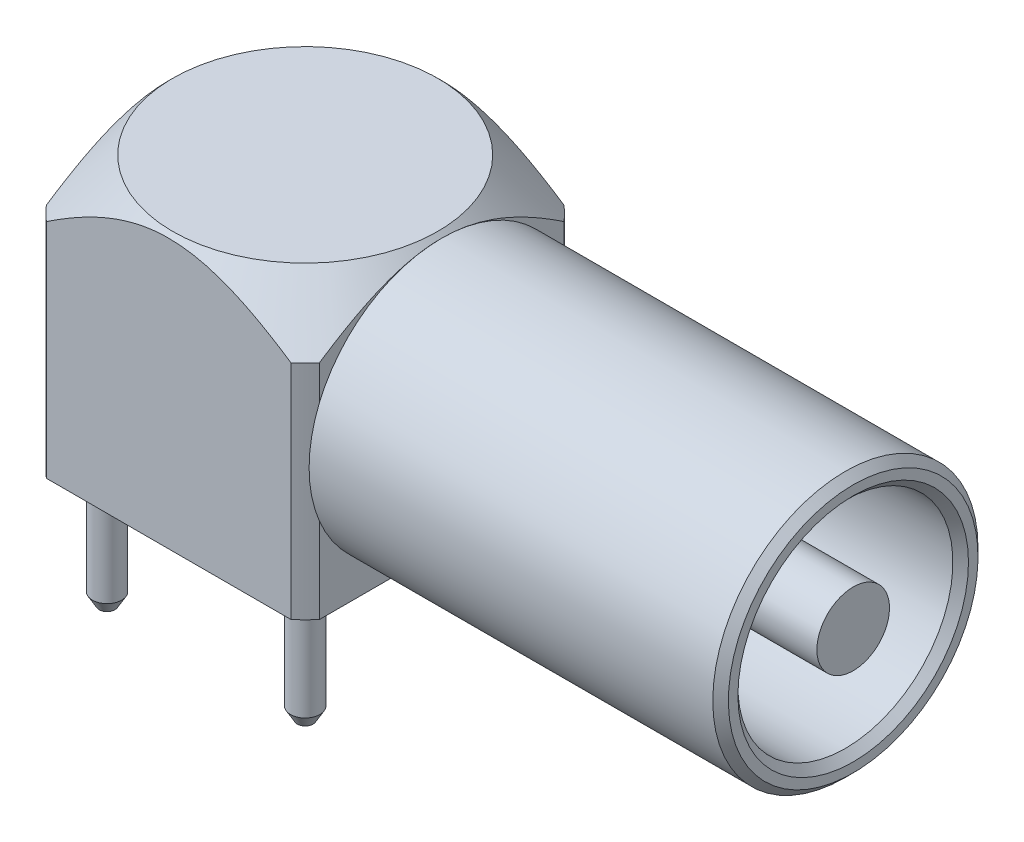
ISO-10303-21;
HEADER;
FILE_DESCRIPTION(('STEP AP214'),'2;1');
FILE_NAME('part.step','',(''),(''),'','','');
FILE_SCHEMA(('AUTOMOTIVE_DESIGN { 1 0 10303 214 1 1 1 1 }'));
ENDSEC;
DATA;
#1=APPLICATION_CONTEXT('core data for automotive mechanical design processes');
#2=APPLICATION_PROTOCOL_DEFINITION('international standard','automotive_design',2000,#1);
#3=PRODUCT_CONTEXT('',#1,'mechanical');
#4=PRODUCT('Part','Part','',(#3));
#5=PRODUCT_RELATED_PRODUCT_CATEGORY('part','',(#4));
#6=PRODUCT_DEFINITION_FORMATION('','',#4);
#7=PRODUCT_DEFINITION_CONTEXT('part definition',#1,'design');
#8=PRODUCT_DEFINITION('design','',#6,#7);
#9=PRODUCT_DEFINITION_SHAPE('','',#8);
#10=(LENGTH_UNIT() NAMED_UNIT(*) SI_UNIT(.MILLI.,.METRE.));
#11=(NAMED_UNIT(*) PLANE_ANGLE_UNIT() SI_UNIT($,.RADIAN.));
#12=(NAMED_UNIT(*) SI_UNIT($,.STERADIAN.) SOLID_ANGLE_UNIT());
#13=UNCERTAINTY_MEASURE_WITH_UNIT(LENGTH_MEASURE(1.E-05),#10,'distance_accuracy_value','');
#14=(GEOMETRIC_REPRESENTATION_CONTEXT(3) GLOBAL_UNCERTAINTY_ASSIGNED_CONTEXT((#13)) GLOBAL_UNIT_ASSIGNED_CONTEXT((#10,
#11,#12)) REPRESENTATION_CONTEXT('',''));
#15=CARTESIAN_POINT('',(0.,0.,0.));
#16=DIRECTION('',(0.,0.,1.));
#17=DIRECTION('',(1.,0.,0.));
#18=AXIS2_PLACEMENT_3D('',#15,#16,#17);
#19=CARTESIAN_POINT('',(-10.55,3.5,-8.75251334901552E-07));
#20=DIRECTION('',(1.,0.,0.));
#21=DIRECTION('',(0.,1.,0.));
#22=AXIS2_PLACEMENT_3D('',#19,#20,#21);
#23=PLANE('',#22);
#24=CARTESIAN_POINT('',(-10.55,2.2,-3.13687830352296));
#25=CARTESIAN_POINT('',(-10.55,3.4,-1.33891197268435));
#26=CARTESIAN_POINT('',(-10.55,3.4,-8.75251335255347E-07));
#27=(BOUNDED_CURVE() B_SPLINE_CURVE(2,(#24,#25,#26),.UNSPECIFIED.,.F.,
.F.) B_SPLINE_CURVE_WITH_KNOTS((3,3),(0.0289629394687463,0.378837270102338),
.UNSPECIFIED.) CURVE() GEOMETRIC_REPRESENTATION_ITEM() RATIONAL_B_SPLINE_CURVE((1.03045700832998,
1.20710678118655,1.20710678118655)) REPRESENTATION_ITEM(''));
#28=CARTESIAN_POINT('',(-10.55,2.2,-3.13687830352296));
#29=VERTEX_POINT('',#28);
#30=CARTESIAN_POINT('',(-10.55,3.4,-8.75251334901552E-07));
#31=VERTEX_POINT('',#30);
#32=EDGE_CURVE('E318',#29,#31,#27,.T.);
#33=ORIENTED_EDGE('',*,*,#32,.T.);
#34=CARTESIAN_POINT('',(-10.55,0.,-8.75251334901552E-07));
#35=DIRECTION('',(-1.,0.,0.));
#36=DIRECTION('',(0.,1.,0.));
#37=AXIS2_PLACEMENT_3D('',#34,#35,#36);
#38=CIRCLE('',#37,3.4);
#39=CARTESIAN_POINT('',(-10.55,1.31148770486039,-3.13687830352296));
#40=VERTEX_POINT('',#39);
#41=EDGE_CURVE('E266',#31,#40,#38,.T.);
#42=ORIENTED_EDGE('',*,*,#41,.T.);
#43=DIRECTION('',(0.,1.,0.));
#44=VECTOR('',#43,1.);
#45=CARTESIAN_POINT('',(-10.55,-3.5,-3.13687830352296));
#46=LINE('',#45,#44);
#47=EDGE_CURVE('E254',#40,#29,#46,.T.);
#48=ORIENTED_EDGE('',*,*,#47,.T.);
#49=EDGE_LOOP('',(#33,#42,#48));
#50=FACE_BOUND('',#49,.T.);
#51=ADVANCED_FACE('F49',(#50),#23,.T.);
#52=CARTESIAN_POINT('',(-14.05,0.,-3.50000087525133));
#53=DIRECTION('',(0.,0.,1.));
#54=DIRECTION('',(1.,0.,0.));
#55=AXIS2_PLACEMENT_3D('',#52,#53,#54);
#56=PLANE('',#55);
#57=CARTESIAN_POINT('',(-17.1868774282716,2.2,-3.50000087525134));
#58=CARTESIAN_POINT('',(-14.0500000000002,4.29361702127646,-3.50000087525133));
#59=CARTESIAN_POINT('',(-10.9131225717291,2.20000000000048,-3.50000087525133));
#60=(BOUNDED_CURVE() B_SPLINE_CURVE(2,(#57,#58,#59),.UNSPECIFIED.,.F.,
.F.) B_SPLINE_CURVE_WITH_KNOTS((3,3),(0.0289629394687464,0.728711600736026),
.UNSPECIFIED.) CURVE() GEOMETRIC_REPRESENTATION_ITEM() RATIONAL_B_SPLINE_CURVE((1.03045700832998,
1.38375655404309,1.03045700833004)) REPRESENTATION_ITEM(''));
#61=CARTESIAN_POINT('',(-17.1868774282716,2.2,-3.50000087525133));
#62=VERTEX_POINT('',#61);
#63=CARTESIAN_POINT('',(-10.9131225717284,2.2,-3.50000087525134));
#64=VERTEX_POINT('',#63);
#65=EDGE_CURVE('E347',#62,#64,#60,.T.);
#66=ORIENTED_EDGE('',*,*,#65,.T.);
#67=DIRECTION('',(0.,-1.,0.));
#68=VECTOR('',#67,1.);
#69=CARTESIAN_POINT('',(-10.9131225717284,-3.5,-3.50000087525133));
#70=LINE('',#69,#68);
#71=CARTESIAN_POINT('',(-10.9131225717284,-3.5,-3.50000087525133));
#72=VERTEX_POINT('',#71);
#73=EDGE_CURVE('E250',#64,#72,#70,.T.);
#74=ORIENTED_EDGE('',*,*,#73,.T.);
#75=DIRECTION('',(1.,0.,0.));
#76=VECTOR('',#75,1.);
#77=CARTESIAN_POINT('',(-10.55,-3.5,-3.50000087525133));
#78=LINE('',#77,#76);
#79=CARTESIAN_POINT('',(-17.1868774282716,-3.5,-3.50000087525133));
#80=VERTEX_POINT('',#79);
#81=EDGE_CURVE('E333',#80,#72,#78,.T.);
#82=ORIENTED_EDGE('',*,*,#81,.F.);
#83=DIRECTION('',(0.,1.,0.));
#84=VECTOR('',#83,1.);
#85=CARTESIAN_POINT('',(-17.1868774282716,-3.5,-3.50000087525133));
#86=LINE('',#85,#84);
#87=EDGE_CURVE('E286',#80,#62,#86,.T.);
#88=ORIENTED_EDGE('',*,*,#87,.T.);
#89=EDGE_LOOP('',(#66,#74,#82,#88));
#90=FACE_BOUND('',#89,.T.);
#91=ADVANCED_FACE('F449',(#90),#56,.F.);
#92=CARTESIAN_POINT('',(-11.51,-6.35,-2.54000087525133));
#93=DIRECTION('',(0.,1.,0.));
#94=DIRECTION('',(-0.48171210335396,0.,0.876329532471834));
#95=AXIS2_PLACEMENT_3D('',#92,#93,#94);
#96=CONICAL_SURFACE('',#95,0.288397459621557,0.523598775598299);
#97=CARTESIAN_POINT('',(-11.51,-6.2,-2.54000087525133));
#98=DIRECTION('',(0.,-1.,0.));
#99=DIRECTION('',(-0.48171210335396,0.,0.876329532471834));
#100=AXIS2_PLACEMENT_3D('',#97,#98,#99);
#101=CIRCLE('',#100,0.375);
#102=CARTESIAN_POINT('',(-11.3293579612423,-6.2,-2.86862444992827));
#103=VERTEX_POINT('',#102);
#104=EDGE_CURVE('E397',#103,#103,#101,.T.);
#105=ORIENTED_EDGE('',*,*,#104,.T.);
#106=EDGE_LOOP('',(#105));
#107=FACE_BOUND('',#106,.T.);
#108=CARTESIAN_POINT('',(-11.51,-6.5,-2.54000087525133));
#109=DIRECTION('',(0.,1.,0.));
#110=DIRECTION('',(-0.48171210335396,0.,0.876329532471834));
#111=AXIS2_PLACEMENT_3D('',#108,#109,#110);
#112=CIRCLE('',#111,0.201794919243113);
#113=CARTESIAN_POINT('',(-11.4127929450053,-6.5,-2.71683972248684));
#114=VERTEX_POINT('',#113);
#115=EDGE_CURVE('E67',#114,#114,#112,.T.);
#116=ORIENTED_EDGE('',*,*,#115,.T.);
#117=EDGE_LOOP('',(#116));
#118=FACE_BOUND('',#117,.T.);
#119=ADVANCED_FACE('F458',(#107,#118),#96,.T.);
#120=CARTESIAN_POINT('',(-11.4196789806211,-6.5,-2.7043126625898));
#121=DIRECTION('',(0.,-1.,0.));
#122=DIRECTION('',(0.,0.,-1.));
#123=AXIS2_PLACEMENT_3D('',#120,#121,#122);
#124=PLANE('',#123);
#125=ORIENTED_EDGE('',*,*,#115,.F.);
#126=EDGE_LOOP('',(#125));
#127=FACE_BOUND('',#126,.T.);
#128=ADVANCED_FACE('F538',(#127),#124,.T.);
#129=CARTESIAN_POINT('',(-11.51,-4.9,-2.54000087525133));
#130=DIRECTION('',(0.,1.,0.));
#131=DIRECTION('',(0.48171210335396,0.,-0.876329532471834));
#132=AXIS2_PLACEMENT_3D('',#129,#130,#131);
#133=CYLINDRICAL_SURFACE('',#132,0.375);
#134=CARTESIAN_POINT('',(-11.51,-3.5,-2.54000087525133));
#135=DIRECTION('',(0.,-1.,0.));
#136=DIRECTION('',(0.48171210335396,0.,-0.876329532471834));
#137=AXIS2_PLACEMENT_3D('',#134,#135,#136);
#138=CIRCLE('',#137,0.375);
#139=CARTESIAN_POINT('',(-11.6906420387577,-3.5,-2.21137730057439));
#140=VERTEX_POINT('',#139);
#141=EDGE_CURVE('E248',#140,#140,#138,.T.);
#142=ORIENTED_EDGE('',*,*,#141,.T.);
#143=EDGE_LOOP('',(#142));
#144=FACE_BOUND('',#143,.T.);
#145=ORIENTED_EDGE('',*,*,#104,.F.);
#146=EDGE_LOOP('',(#145));
#147=FACE_BOUND('',#146,.T.);
#148=ADVANCED_FACE('F493',(#144,#147),#133,.T.);
#149=CARTESIAN_POINT('',(-11.51,-6.35,2.53999912474866));
#150=DIRECTION('',(0.,1.,0.));
#151=DIRECTION('',(-0.48171210335396,0.,0.876329532471834));
#152=AXIS2_PLACEMENT_3D('',#149,#150,#151);
#153=CONICAL_SURFACE('',#152,0.288397459621557,0.523598775598299);
#154=CARTESIAN_POINT('',(-11.51,-6.2,2.53999912474866));
#155=DIRECTION('',(0.,-1.,0.));
#156=DIRECTION('',(-0.48171210335396,0.,0.876329532471834));
#157=AXIS2_PLACEMENT_3D('',#154,#155,#156);
#158=CIRCLE('',#157,0.375);
#159=CARTESIAN_POINT('',(-11.3293579612423,-6.2,2.21137555007173));
#160=VERTEX_POINT('',#159);
#161=EDGE_CURVE('E253',#160,#160,#158,.T.);
#162=ORIENTED_EDGE('',*,*,#161,.T.);
#163=EDGE_LOOP('',(#162));
#164=FACE_BOUND('',#163,.T.);
#165=CARTESIAN_POINT('',(-11.51,-6.5,2.53999912474866));
#166=DIRECTION('',(0.,1.,0.));
#167=DIRECTION('',(-0.48171210335396,0.,0.876329532471834));
#168=AXIS2_PLACEMENT_3D('',#165,#166,#167);
#169=CIRCLE('',#168,0.201794919243113);
#170=CARTESIAN_POINT('',(-11.4127929450053,-6.5,2.36316027751316));
#171=VERTEX_POINT('',#170);
#172=EDGE_CURVE('E353',#171,#171,#169,.T.);
#173=ORIENTED_EDGE('',*,*,#172,.T.);
#174=EDGE_LOOP('',(#173));
#175=FACE_BOUND('',#174,.T.);
#176=ADVANCED_FACE('F489',(#164,#175),#153,.T.);
#177=CARTESIAN_POINT('',(-11.4196789806211,-6.5,2.3756873374102));
#178=DIRECTION('',(0.,-1.,0.));
#179=DIRECTION('',(0.,0.,-1.));
#180=AXIS2_PLACEMENT_3D('',#177,#178,#179);
#181=PLANE('',#180);
#182=ORIENTED_EDGE('',*,*,#172,.F.);
#183=EDGE_LOOP('',(#182));
#184=FACE_BOUND('',#183,.T.);
#185=ADVANCED_FACE('F492',(#184),#181,.T.);
#186=CARTESIAN_POINT('',(-11.51,-4.9,2.53999912474867));
#187=DIRECTION('',(0.,1.,0.));
#188=DIRECTION('',(0.48171210335396,0.,-0.876329532471834));
#189=AXIS2_PLACEMENT_3D('',#186,#187,#188);
#190=CYLINDRICAL_SURFACE('',#189,0.375);
#191=CARTESIAN_POINT('',(-11.51,-3.5,2.53999912474867));
#192=DIRECTION('',(0.,-1.,0.));
#193=DIRECTION('',(0.48171210335396,0.,-0.876329532471834));
#194=AXIS2_PLACEMENT_3D('',#191,#192,#193);
#195=CIRCLE('',#194,0.375);
#196=CARTESIAN_POINT('',(-11.6906420387577,-3.5,2.86862269942561));
#197=VERTEX_POINT('',#196);
#198=EDGE_CURVE('E234',#197,#197,#195,.T.);
#199=ORIENTED_EDGE('',*,*,#198,.T.);
#200=EDGE_LOOP('',(#199));
#201=FACE_BOUND('',#200,.T.);
#202=ORIENTED_EDGE('',*,*,#161,.F.);
#203=EDGE_LOOP('',(#202));
#204=FACE_BOUND('',#203,.T.);
#205=ADVANCED_FACE('F504',(#201,#204),#190,.T.);
#206=CARTESIAN_POINT('',(-10.55,3.5,-8.75251334901552E-07));
#207=DIRECTION('',(1.,0.,0.));
#208=DIRECTION('',(0.,1.,0.));
#209=AXIS2_PLACEMENT_3D('',#206,#207,#208);
#210=PLANE('',#209);
#211=CARTESIAN_POINT('',(-10.55,0.,-8.75251334901552E-07));
#212=DIRECTION('',(-1.,0.,0.));
#213=DIRECTION('',(0.,1.,0.));
#214=AXIS2_PLACEMENT_3D('',#211,#212,#213);
#215=CIRCLE('',#214,3.4);
#216=CARTESIAN_POINT('',(-10.55,1.31148770486039,3.13687655302029));
#217=VERTEX_POINT('',#216);
#218=EDGE_CURVE('E261',#217,#31,#215,.T.);
#219=ORIENTED_EDGE('',*,*,#218,.T.);
#220=CARTESIAN_POINT('',(-10.55,3.4,-8.75251335255347E-07));
#221=CARTESIAN_POINT('',(-10.55,3.4,1.33891022218167));
#222=CARTESIAN_POINT('',(-10.55,2.2,3.13687655302029));
#223=(BOUNDED_CURVE() B_SPLINE_CURVE(2,(#220,#221,#222),.UNSPECIFIED.,.F.,
.F.) B_SPLINE_CURVE_WITH_KNOTS((3,3),(0.378837270102338,0.728711600735929),
.UNSPECIFIED.) CURVE() GEOMETRIC_REPRESENTATION_ITEM() RATIONAL_B_SPLINE_CURVE((1.20710678118655,
1.20710678118655,1.03045700832998)) REPRESENTATION_ITEM(''));
#224=CARTESIAN_POINT('',(-10.55,2.2,3.13687655302029));
#225=VERTEX_POINT('',#224);
#226=EDGE_CURVE('E309',#31,#225,#223,.T.);
#227=ORIENTED_EDGE('',*,*,#226,.T.);
#228=DIRECTION('',(0.,-1.,0.));
#229=VECTOR('',#228,1.);
#230=CARTESIAN_POINT('',(-10.55,-3.5,3.13687655302029));
#231=LINE('',#230,#229);
#232=EDGE_CURVE('E289',#225,#217,#231,.T.);
#233=ORIENTED_EDGE('',*,*,#232,.T.);
#234=EDGE_LOOP('',(#219,#227,#233));
#235=FACE_BOUND('',#234,.T.);
#236=ADVANCED_FACE('F501',(#235),#210,.T.);
#237=CARTESIAN_POINT('',(-14.05,-3.5,-8.75251334901552E-07));
#238=DIRECTION('',(0.,1.,0.));
#239=DIRECTION('',(-0.667420729419494,0.,0.74468085106383));
#240=AXIS2_PLACEMENT_3D('',#237,#238,#239);
#241=CYLINDRICAL_SURFACE('',#240,4.7);
#242=CARTESIAN_POINT('',(-14.05,2.2,-8.75251334901552E-07));
#243=DIRECTION('',(0.,1.,0.));
#244=DIRECTION('',(-0.667420729419494,0.,0.74468085106383));
#245=AXIS2_PLACEMENT_3D('',#242,#243,#244);
#246=CIRCLE('',#245,4.7);
#247=EDGE_CURVE('E343',#29,#64,#246,.T.);
#248=ORIENTED_EDGE('',*,*,#247,.F.);
#249=ORIENTED_EDGE('',*,*,#47,.F.);
#250=DIRECTION('',(0.,1.,0.));
#251=VECTOR('',#250,1.);
#252=CARTESIAN_POINT('',(-10.55,-3.5,-3.13687830352296));
#253=LINE('',#252,#251);
#254=CARTESIAN_POINT('',(-10.55,-1.31148770486039,-3.13687830352296));
#255=VERTEX_POINT('',#254);
#256=EDGE_CURVE('E281',#255,#40,#253,.T.);
#257=ORIENTED_EDGE('',*,*,#256,.F.);
#258=DIRECTION('',(0.,1.,0.));
#259=VECTOR('',#258,1.);
#260=CARTESIAN_POINT('',(-10.55,-3.5,-3.13687830352296));
#261=LINE('',#260,#259);
#262=CARTESIAN_POINT('',(-10.55,-3.5,-3.13687830352296));
#263=VERTEX_POINT('',#262);
#264=EDGE_CURVE('E298',#263,#255,#261,.T.);
#265=ORIENTED_EDGE('',*,*,#264,.F.);
#266=CARTESIAN_POINT('',(-14.05,-3.5,-8.75251334901552E-07));
#267=DIRECTION('',(0.,-1.,0.));
#268=DIRECTION('',(-0.667420729419494,0.,0.74468085106383));
#269=AXIS2_PLACEMENT_3D('',#266,#267,#268);
#270=CIRCLE('',#269,4.7);
#271=EDGE_CURVE('E249',#72,#263,#270,.T.);
#272=ORIENTED_EDGE('',*,*,#271,.F.);
#273=ORIENTED_EDGE('',*,*,#73,.F.);
#274=EDGE_LOOP('',(#248,#249,#257,#265,#272,#273));
#275=FACE_BOUND('',#274,.T.);
#276=ADVANCED_FACE('F481',(#275),#241,.T.);
#277=CARTESIAN_POINT('',(-14.05,-3.5,-8.75251334901552E-07));
#278=DIRECTION('',(0.,1.,0.));
#279=DIRECTION('',(0.74468085106383,0.,0.667420729419495));
#280=AXIS2_PLACEMENT_3D('',#277,#278,#279);
#281=CYLINDRICAL_SURFACE('',#280,4.7);
#282=CARTESIAN_POINT('',(-14.05,2.2,-8.75251334901552E-07));
#283=DIRECTION('',(0.,1.,0.));
#284=DIRECTION('',(0.74468085106383,0.,0.667420729419495));
#285=AXIS2_PLACEMENT_3D('',#282,#283,#284);
#286=CIRCLE('',#285,4.7);
#287=CARTESIAN_POINT('',(-17.55,2.2,-3.13687830352296));
#288=VERTEX_POINT('',#287);
#289=EDGE_CURVE('E342',#62,#288,#286,.T.);
#290=ORIENTED_EDGE('',*,*,#289,.F.);
#291=ORIENTED_EDGE('',*,*,#87,.F.);
#292=CARTESIAN_POINT('',(-14.05,-3.5,-8.75251334901552E-07));
#293=DIRECTION('',(0.,-1.,0.));
#294=DIRECTION('',(0.74468085106383,0.,0.667420729419495));
#295=AXIS2_PLACEMENT_3D('',#292,#293,#294);
#296=CIRCLE('',#295,4.7);
#297=CARTESIAN_POINT('',(-17.55,-3.5,-3.13687830352296));
#298=VERTEX_POINT('',#297);
#299=EDGE_CURVE('E259',#298,#80,#296,.T.);
#300=ORIENTED_EDGE('',*,*,#299,.F.);
#301=DIRECTION('',(0.,-1.,0.));
#302=VECTOR('',#301,1.);
#303=CARTESIAN_POINT('',(-17.55,-3.5,-3.13687830352296));
#304=LINE('',#303,#302);
#305=EDGE_CURVE('E307',#288,#298,#304,.T.);
#306=ORIENTED_EDGE('',*,*,#305,.F.);
#307=EDGE_LOOP('',(#290,#291,#300,#306));
#308=FACE_BOUND('',#307,.T.);
#309=ADVANCED_FACE('F477',(#308),#281,.T.);
#310=CARTESIAN_POINT('',(-14.05,-3.5,-8.75251334901552E-07));
#311=DIRECTION('',(0.,1.,0.));
#312=DIRECTION('',(0.667420729419495,0.,-0.74468085106383));
#313=AXIS2_PLACEMENT_3D('',#310,#311,#312);
#314=CYLINDRICAL_SURFACE('',#313,4.7);
#315=CARTESIAN_POINT('',(-14.05,2.2,-8.75251334901552E-07));
#316=DIRECTION('',(0.,1.,0.));
#317=DIRECTION('',(0.667420729419495,0.,-0.74468085106383));
#318=AXIS2_PLACEMENT_3D('',#315,#316,#317);
#319=CIRCLE('',#318,4.7);
#320=CARTESIAN_POINT('',(-17.55,2.2,3.13687655302029));
#321=VERTEX_POINT('',#320);
#322=CARTESIAN_POINT('',(-17.1868774282716,2.2,3.49999912474867));
#323=VERTEX_POINT('',#322);
#324=EDGE_CURVE('E339',#321,#323,#319,.T.);
#325=ORIENTED_EDGE('',*,*,#324,.F.);
#326=DIRECTION('',(0.,1.,0.));
#327=VECTOR('',#326,1.);
#328=CARTESIAN_POINT('',(-17.55,-3.5,3.13687655302029));
#329=LINE('',#328,#327);
#330=CARTESIAN_POINT('',(-17.55,-3.5,3.13687655302029));
#331=VERTEX_POINT('',#330);
#332=EDGE_CURVE('E348',#331,#321,#329,.T.);
#333=ORIENTED_EDGE('',*,*,#332,.F.);
#334=CARTESIAN_POINT('',(-14.05,-3.5,-8.75251334901552E-07));
#335=DIRECTION('',(0.,-1.,0.));
#336=DIRECTION('',(0.667420729419495,0.,-0.74468085106383));
#337=AXIS2_PLACEMENT_3D('',#334,#335,#336);
#338=CIRCLE('',#337,4.7);
#339=CARTESIAN_POINT('',(-17.1868774282716,-3.5,3.49999912474867));
#340=VERTEX_POINT('',#339);
#341=EDGE_CURVE('E260',#340,#331,#338,.T.);
#342=ORIENTED_EDGE('',*,*,#341,.F.);
#343=DIRECTION('',(0.,-1.,0.));
#344=VECTOR('',#343,1.);
#345=CARTESIAN_POINT('',(-17.1868774282716,-3.5,3.49999912474867));
#346=LINE('',#345,#344);
#347=EDGE_CURVE('E385',#323,#340,#346,.T.);
#348=ORIENTED_EDGE('',*,*,#347,.F.);
#349=EDGE_LOOP('',(#325,#333,#342,#348));
#350=FACE_BOUND('',#349,.T.);
#351=ADVANCED_FACE('F480',(#350),#314,.T.);
#352=CARTESIAN_POINT('',(-14.05,-3.5,-8.75251334901552E-07));
#353=DIRECTION('',(0.,1.,0.));
#354=DIRECTION('',(-0.74468085106383,0.,-0.667420729419495));
#355=AXIS2_PLACEMENT_3D('',#352,#353,#354);
#356=CYLINDRICAL_SURFACE('',#355,4.7);
#357=CARTESIAN_POINT('',(-14.05,2.2,-8.75251334901552E-07));
#358=DIRECTION('',(0.,1.,0.));
#359=DIRECTION('',(-0.74468085106383,0.,-0.667420729419495));
#360=AXIS2_PLACEMENT_3D('',#357,#358,#359);
#361=CIRCLE('',#360,4.7);
#362=CARTESIAN_POINT('',(-10.9131225717284,2.2,3.49999912474867));
#363=VERTEX_POINT('',#362);
#364=EDGE_CURVE('E319',#363,#225,#361,.T.);
#365=ORIENTED_EDGE('',*,*,#364,.F.);
#366=DIRECTION('',(0.,1.,0.));
#367=VECTOR('',#366,1.);
#368=CARTESIAN_POINT('',(-10.9131225717284,-3.5,3.49999912474867));
#369=LINE('',#368,#367);
#370=CARTESIAN_POINT('',(-10.9131225717284,-3.5,3.49999912474867));
#371=VERTEX_POINT('',#370);
#372=EDGE_CURVE('E382',#371,#363,#369,.T.);
#373=ORIENTED_EDGE('',*,*,#372,.F.);
#374=CARTESIAN_POINT('',(-14.05,-3.5,-8.75251334901552E-07));
#375=DIRECTION('',(0.,-1.,0.));
#376=DIRECTION('',(-0.74468085106383,0.,-0.667420729419495));
#377=AXIS2_PLACEMENT_3D('',#374,#375,#376);
#378=CIRCLE('',#377,4.7);
#379=CARTESIAN_POINT('',(-10.55,-3.5,3.13687655302029));
#380=VERTEX_POINT('',#379);
#381=EDGE_CURVE('E240',#380,#371,#378,.T.);
#382=ORIENTED_EDGE('',*,*,#381,.F.);
#383=DIRECTION('',(0.,-1.,0.));
#384=VECTOR('',#383,1.);
#385=CARTESIAN_POINT('',(-10.55,-3.5,3.13687655302029));
#386=LINE('',#385,#384);
#387=CARTESIAN_POINT('',(-10.55,-1.3114877048604,3.13687655302029));
#388=VERTEX_POINT('',#387);
#389=EDGE_CURVE('E265',#388,#380,#386,.T.);
#390=ORIENTED_EDGE('',*,*,#389,.F.);
#391=DIRECTION('',(0.,-1.,0.));
#392=VECTOR('',#391,1.);
#393=CARTESIAN_POINT('',(-10.55,-3.5,3.13687655302029));
#394=LINE('',#393,#392);
#395=EDGE_CURVE('E275',#217,#388,#394,.T.);
#396=ORIENTED_EDGE('',*,*,#395,.F.);
#397=ORIENTED_EDGE('',*,*,#232,.F.);
#398=EDGE_LOOP('',(#365,#373,#382,#390,#396,#397));
#399=FACE_BOUND('',#398,.T.);
#400=ADVANCED_FACE('F487',(#399),#356,.T.);
#401=CARTESIAN_POINT('',(-14.05,2.72512626584708,-8.75251334901552E-07));
#402=DIRECTION('',(0.,-1.,0.));
#403=DIRECTION('',(-0.707106781186548,0.,0.707106781186548));
#404=AXIS2_PLACEMENT_3D('',#401,#402,#403);
#405=CONICAL_SURFACE('',#404,4.17487373415292,0.785398163397448);
#406=CARTESIAN_POINT('',(-14.05,3.5,-8.75251334901552E-07));
#407=DIRECTION('',(0.,1.,0.));
#408=DIRECTION('',(-0.707106781186548,0.,0.707106781186548));
#409=AXIS2_PLACEMENT_3D('',#406,#407,#408);
#410=CIRCLE('',#409,3.4);
#411=CARTESIAN_POINT('',(-11.6458369439657,3.5,-2.40416393128559));
#412=VERTEX_POINT('',#411);
#413=EDGE_CURVE('E308',#412,#412,#410,.T.);
#414=ORIENTED_EDGE('',*,*,#413,.F.);
#415=EDGE_LOOP('',(#414));
#416=FACE_BOUND('',#415,.T.);
#417=ORIENTED_EDGE('',*,*,#247,.T.);
#418=ORIENTED_EDGE('',*,*,#65,.F.);
#419=ORIENTED_EDGE('',*,*,#289,.T.);
#420=CARTESIAN_POINT('',(-17.55,2.2,3.13687655302029));
#421=CARTESIAN_POINT('',(-17.55,4.29361702127646,-8.75251133951185E-07));
#422=CARTESIAN_POINT('',(-17.55,2.20000000000048,-3.13687830352224));
#423=(BOUNDED_CURVE() B_SPLINE_CURVE(2,(#420,#421,#422),.UNSPECIFIED.,.F.,
.F.) B_SPLINE_CURVE_WITH_KNOTS((3,3),(0.0289629394687476,0.72871160073603),
.UNSPECIFIED.) CURVE() GEOMETRIC_REPRESENTATION_ITEM() RATIONAL_B_SPLINE_CURVE((1.03045700832998,
1.38375655404308,1.03045700833004)) REPRESENTATION_ITEM(''));
#424=EDGE_CURVE('E301',#321,#288,#423,.T.);
#425=ORIENTED_EDGE('',*,*,#424,.F.);
#426=ORIENTED_EDGE('',*,*,#324,.T.);
#427=CARTESIAN_POINT('',(-10.9131225717284,2.2,3.49999912474867));
#428=CARTESIAN_POINT('',(-14.05,4.29361702127659,3.49999912474867));
#429=CARTESIAN_POINT('',(-17.1868774282716,2.2,3.49999912474867));
#430=(BOUNDED_CURVE() B_SPLINE_CURVE(2,(#427,#428,#429),.UNSPECIFIED.,.F.,
.F.) B_SPLINE_CURVE_WITH_KNOTS((3,3),(0.0289629394687464,0.728711600735929),
.UNSPECIFIED.) CURVE() GEOMETRIC_REPRESENTATION_ITEM() RATIONAL_B_SPLINE_CURVE((1.03045700832998,
1.38375655404312,1.03045700832998)) REPRESENTATION_ITEM(''));
#431=EDGE_CURVE('E388',#363,#323,#430,.T.);
#432=ORIENTED_EDGE('',*,*,#431,.F.);
#433=ORIENTED_EDGE('',*,*,#364,.T.);
#434=ORIENTED_EDGE('',*,*,#226,.F.);
#435=ORIENTED_EDGE('',*,*,#32,.F.);
#436=EDGE_LOOP('',(#417,#418,#419,#425,#426,#432,#433,#434,#435));
#437=FACE_BOUND('',#436,.T.);
#438=ADVANCED_FACE('F483',(#416,#437),#405,.T.);
#439=CARTESIAN_POINT('',(-17.55,-3.5,-8.75251334901552E-07));
#440=DIRECTION('',(-1.,0.,0.));
#441=DIRECTION('',(0.,0.,1.));
#442=AXIS2_PLACEMENT_3D('',#439,#440,#441);
#443=PLANE('',#442);
#444=ORIENTED_EDGE('',*,*,#424,.T.);
#445=ORIENTED_EDGE('',*,*,#305,.T.);
#446=DIRECTION('',(0.,0.,-1.));
#447=VECTOR('',#446,1.);
#448=CARTESIAN_POINT('',(-17.55,-3.5,-8.75251334901552E-07));
#449=LINE('',#448,#447);
#450=EDGE_CURVE('E255',#331,#298,#449,.T.);
#451=ORIENTED_EDGE('',*,*,#450,.F.);
#452=ORIENTED_EDGE('',*,*,#332,.T.);
#453=EDGE_LOOP('',(#444,#445,#451,#452));
#454=FACE_BOUND('',#453,.T.);
#455=ADVANCED_FACE('F486',(#454),#443,.T.);
#456=CARTESIAN_POINT('',(-17.55,3.5,-8.75251334901552E-07));
#457=DIRECTION('',(0.,1.,0.));
#458=DIRECTION('',(1.,0.,0.));
#459=AXIS2_PLACEMENT_3D('',#456,#457,#458);
#460=PLANE('',#459);
#461=ORIENTED_EDGE('',*,*,#413,.T.);
#462=EDGE_LOOP('',(#461));
#463=FACE_BOUND('',#462,.T.);
#464=ADVANCED_FACE('F510',(#463),#460,.T.);
#465=CARTESIAN_POINT('',(-14.05,0.,3.49999912474867));
#466=DIRECTION('',(0.,0.,1.));
#467=DIRECTION('',(1.,0.,0.));
#468=AXIS2_PLACEMENT_3D('',#465,#466,#467);
#469=PLANE('',#468);
#470=ORIENTED_EDGE('',*,*,#431,.T.);
#471=ORIENTED_EDGE('',*,*,#347,.T.);
#472=DIRECTION('',(-1.,0.,0.));
#473=VECTOR('',#472,1.);
#474=CARTESIAN_POINT('',(-10.55,-3.5,3.49999912474867));
#475=LINE('',#474,#473);
#476=EDGE_CURVE('E243',#371,#340,#475,.T.);
#477=ORIENTED_EDGE('',*,*,#476,.F.);
#478=ORIENTED_EDGE('',*,*,#372,.T.);
#479=EDGE_LOOP('',(#470,#471,#477,#478));
#480=FACE_BOUND('',#479,.T.);
#481=ADVANCED_FACE('F513',(#480),#469,.T.);
#482=CARTESIAN_POINT('',(-16.59,-6.35,2.53999912474866));
#483=DIRECTION('',(0.,1.,0.));
#484=DIRECTION('',(-0.48171210335396,0.,0.876329532471834));
#485=AXIS2_PLACEMENT_3D('',#482,#483,#484);
#486=CONICAL_SURFACE('',#485,0.288397459621557,0.523598775598299);
#487=CARTESIAN_POINT('',(-16.59,-6.2,2.53999912474866));
#488=DIRECTION('',(0.,-1.,0.));
#489=DIRECTION('',(-0.48171210335396,0.,0.876329532471834));
#490=AXIS2_PLACEMENT_3D('',#487,#488,#489);
#491=CIRCLE('',#490,0.375);
#492=CARTESIAN_POINT('',(-16.4093579612423,-6.2,2.21137555007172));
#493=VERTEX_POINT('',#492);
#494=EDGE_CURVE('E279',#493,#493,#491,.T.);
#495=ORIENTED_EDGE('',*,*,#494,.T.);
#496=EDGE_LOOP('',(#495));
#497=FACE_BOUND('',#496,.T.);
#498=CARTESIAN_POINT('',(-16.59,-6.5,2.53999912474866));
#499=DIRECTION('',(0.,1.,0.));
#500=DIRECTION('',(-0.48171210335396,0.,0.876329532471834));
#501=AXIS2_PLACEMENT_3D('',#498,#499,#500);
#502=CIRCLE('',#501,0.201794919243113);
#503=CARTESIAN_POINT('',(-16.4927929450053,-6.5,2.36316027751315));
#504=VERTEX_POINT('',#503);
#505=EDGE_CURVE('E379',#504,#504,#502,.T.);
#506=ORIENTED_EDGE('',*,*,#505,.T.);
#507=EDGE_LOOP('',(#506));
#508=FACE_BOUND('',#507,.T.);
#509=ADVANCED_FACE('F528',(#497,#508),#486,.T.);
#510=CARTESIAN_POINT('',(-16.4996789806211,-6.5,2.37568733741019));
#511=DIRECTION('',(0.,-1.,0.));
#512=DIRECTION('',(0.,0.,-1.));
#513=AXIS2_PLACEMENT_3D('',#510,#511,#512);
#514=PLANE('',#513);
#515=ORIENTED_EDGE('',*,*,#505,.F.);
#516=EDGE_LOOP('',(#515));
#517=FACE_BOUND('',#516,.T.);
#518=ADVANCED_FACE('F531',(#517),#514,.T.);
#519=CARTESIAN_POINT('',(-16.59,-4.9,2.53999912474866));
#520=DIRECTION('',(0.,1.,0.));
#521=DIRECTION('',(0.48171210335396,0.,-0.876329532471834));
#522=AXIS2_PLACEMENT_3D('',#519,#520,#521);
#523=CYLINDRICAL_SURFACE('',#522,0.375);
#524=CARTESIAN_POINT('',(-16.59,-3.5,2.53999912474867));
#525=DIRECTION('',(0.,-1.,0.));
#526=DIRECTION('',(0.48171210335396,0.,-0.876329532471834));
#527=AXIS2_PLACEMENT_3D('',#524,#525,#526);
#528=CIRCLE('',#527,0.375);
#529=CARTESIAN_POINT('',(-16.7706420387577,-3.5,2.8686226994256));
#530=VERTEX_POINT('',#529);
#531=EDGE_CURVE('E226',#530,#530,#528,.T.);
#532=ORIENTED_EDGE('',*,*,#531,.T.);
#533=EDGE_LOOP('',(#532));
#534=FACE_BOUND('',#533,.T.);
#535=ORIENTED_EDGE('',*,*,#494,.F.);
#536=EDGE_LOOP('',(#535));
#537=FACE_BOUND('',#536,.T.);
#538=ADVANCED_FACE('F467',(#534,#537),#523,.T.);
#539=CARTESIAN_POINT('',(-14.05,-2.23982312222434,-8.75251334901552E-07));
#540=DIRECTION('',(0.,1.,0.));
#541=DIRECTION('',(-1.,0.,0.));
#542=AXIS2_PLACEMENT_3D('',#539,#540,#541);
#543=CYLINDRICAL_SURFACE('',#542,0.35);
#544=CARTESIAN_POINT('',(-14.05,-3.5,-8.75251334901552E-07));
#545=DIRECTION('',(0.,-1.,0.));
#546=DIRECTION('',(-1.,0.,0.));
#547=AXIS2_PLACEMENT_3D('',#544,#545,#546);
#548=CIRCLE('',#547,0.35);
#549=CARTESIAN_POINT('',(-13.7,-3.5,-8.75251334858689E-07));
#550=VERTEX_POINT('',#549);
#551=EDGE_CURVE('E220',#550,#550,#548,.T.);
#552=ORIENTED_EDGE('',*,*,#551,.T.);
#553=EDGE_LOOP('',(#552));
#554=FACE_BOUND('',#553,.T.);
#555=CARTESIAN_POINT('',(-14.05,-6.01482312222434,-8.75251334901552E-07));
#556=DIRECTION('',(0.,1.,0.));
#557=DIRECTION('',(-1.,0.,0.));
#558=AXIS2_PLACEMENT_3D('',#555,#556,#557);
#559=CIRCLE('',#558,0.35);
#560=CARTESIAN_POINT('',(-13.7,-6.01482312222434,-8.75251334944415E-07));
#561=VERTEX_POINT('',#560);
#562=EDGE_CURVE('E276',#561,#561,#559,.T.);
#563=ORIENTED_EDGE('',*,*,#562,.T.);
#564=EDGE_LOOP('',(#563));
#565=FACE_BOUND('',#564,.T.);
#566=ADVANCED_FACE('F221',(#554,#565),#543,.T.);
#567=CARTESIAN_POINT('',(-14.1383974596216,-6.31482312222434,-8.75251334901552E-07));
#568=DIRECTION('',(0.,-1.,0.));
#569=DIRECTION('',(0.,0.,-1.));
#570=AXIS2_PLACEMENT_3D('',#567,#568,#569);
#571=PLANE('',#570);
#572=CARTESIAN_POINT('',(-14.05,-6.31482312222434,-8.75251334901552E-07));
#573=DIRECTION('',(0.,1.,0.));
#574=DIRECTION('',(-1.,0.,0.));
#575=AXIS2_PLACEMENT_3D('',#572,#573,#574);
#576=CIRCLE('',#575,0.176794919243111);
#577=CARTESIAN_POINT('',(-14.2267949192431,-6.31482312222434,-8.75251334901552E-07));
#578=VERTEX_POINT('',#577);
#579=EDGE_CURVE('E280',#578,#578,#576,.T.);
#580=ORIENTED_EDGE('',*,*,#579,.F.);
#581=EDGE_LOOP('',(#580));
#582=FACE_BOUND('',#581,.T.);
#583=ADVANCED_FACE('F466',(#582),#571,.T.);
#584=CARTESIAN_POINT('',(-14.05,-6.16482312222434,-8.75251334901552E-07));
#585=DIRECTION('',(0.,1.,0.));
#586=DIRECTION('',(-1.,0.,0.));
#587=AXIS2_PLACEMENT_3D('',#584,#585,#586);
#588=CONICAL_SURFACE('',#587,0.263397459621554,0.523598775598299);
#589=ORIENTED_EDGE('',*,*,#562,.F.);
#590=EDGE_LOOP('',(#589));
#591=FACE_BOUND('',#590,.T.);
#592=ORIENTED_EDGE('',*,*,#579,.T.);
#593=EDGE_LOOP('',(#592));
#594=FACE_BOUND('',#593,.T.);
#595=ADVANCED_FACE('F472',(#591,#594),#588,.T.);
#596=CARTESIAN_POINT('',(-10.55,3.5,-8.75251334901552E-07));
#597=DIRECTION('',(1.,0.,0.));
#598=DIRECTION('',(0.,1.,0.));
#599=AXIS2_PLACEMENT_3D('',#596,#597,#598);
#600=PLANE('',#599);
#601=CARTESIAN_POINT('',(-10.55,0.,-8.75251334901552E-07));
#602=DIRECTION('',(-1.,0.,0.));
#603=DIRECTION('',(0.,1.,0.));
#604=AXIS2_PLACEMENT_3D('',#601,#602,#603);
#605=CIRCLE('',#604,3.4);
#606=EDGE_CURVE('E297',#255,#388,#605,.T.);
#607=ORIENTED_EDGE('',*,*,#606,.T.);
#608=ORIENTED_EDGE('',*,*,#389,.T.);
#609=DIRECTION('',(0.,0.,1.));
#610=VECTOR('',#609,1.);
#611=CARTESIAN_POINT('',(-10.55,-3.5,-8.75251334901552E-07));
#612=LINE('',#611,#610);
#613=EDGE_CURVE('E244',#263,#380,#612,.T.);
#614=ORIENTED_EDGE('',*,*,#613,.F.);
#615=ORIENTED_EDGE('',*,*,#264,.T.);
#616=EDGE_LOOP('',(#607,#608,#614,#615));
#617=FACE_BOUND('',#616,.T.);
#618=ADVANCED_FACE('F475',(#617),#600,.T.);
#619=CARTESIAN_POINT('',(-5.275,0.,-8.75251334901552E-07));
#620=DIRECTION('',(1.,0.,0.));
#621=DIRECTION('',(0.,1.,0.));
#622=AXIS2_PLACEMENT_3D('',#619,#620,#621);
#623=CYLINDRICAL_SURFACE('',#622,3.4);
#624=CARTESIAN_POINT('',(-0.2,0.,-8.75251334901552E-07));
#625=DIRECTION('',(1.,0.,0.));
#626=DIRECTION('',(0.,-1.,0.));
#627=AXIS2_PLACEMENT_3D('',#624,#625,#626);
#628=CIRCLE('',#627,3.4);
#629=CARTESIAN_POINT('',(-0.2,-3.4,-8.75251335317932E-07));
#630=VERTEX_POINT('',#629);
#631=EDGE_CURVE('E294',#630,#630,#628,.T.);
#632=ORIENTED_EDGE('',*,*,#631,.F.);
#633=EDGE_LOOP('',(#632));
#634=FACE_BOUND('',#633,.T.);
#635=ORIENTED_EDGE('',*,*,#606,.F.);
#636=CARTESIAN_POINT('',(-10.55,0.,-8.75251334901552E-07));
#637=DIRECTION('',(1.,0.,0.));
#638=DIRECTION('',(0.,1.,0.));
#639=AXIS2_PLACEMENT_3D('',#636,#637,#638);
#640=CIRCLE('',#639,3.4);
#641=EDGE_CURVE('E285',#255,#40,#640,.T.);
#642=ORIENTED_EDGE('',*,*,#641,.T.);
#643=ORIENTED_EDGE('',*,*,#41,.F.);
#644=ORIENTED_EDGE('',*,*,#218,.F.);
#645=CARTESIAN_POINT('',(-10.55,0.,-8.75251334901552E-07));
#646=DIRECTION('',(1.,0.,0.));
#647=DIRECTION('',(0.,1.,0.));
#648=AXIS2_PLACEMENT_3D('',#645,#646,#647);
#649=CIRCLE('',#648,3.4);
#650=EDGE_CURVE('E270',#217,#388,#649,.T.);
#651=ORIENTED_EDGE('',*,*,#650,.T.);
#652=EDGE_LOOP('',(#635,#642,#643,#644,#651));
#653=FACE_BOUND('',#652,.T.);
#654=ADVANCED_FACE('F524',(#634,#653),#623,.T.);
#655=CARTESIAN_POINT('',(-0.1,0.,-8.75251334901552E-07));
#656=DIRECTION('',(-1.,0.,0.));
#657=DIRECTION('',(0.,-1.,0.));
#658=AXIS2_PLACEMENT_3D('',#655,#656,#657);
#659=CONICAL_SURFACE('',#658,3.3,0.785398163397446);
#660=CARTESIAN_POINT('',(0.,0.,-8.75251334901552E-07));
#661=DIRECTION('',(-1.,0.,0.));
#662=DIRECTION('',(0.,-1.,0.));
#663=AXIS2_PLACEMENT_3D('',#660,#661,#662);
#664=CIRCLE('',#663,3.2);
#665=CARTESIAN_POINT('',(0.,3.2,-8.75251335293439E-07));
#666=VERTEX_POINT('',#665);
#667=EDGE_CURVE('E274',#666,#666,#664,.T.);
#668=ORIENTED_EDGE('',*,*,#667,.T.);
#669=EDGE_LOOP('',(#668));
#670=FACE_BOUND('',#669,.T.);
#671=ORIENTED_EDGE('',*,*,#631,.T.);
#672=EDGE_LOOP('',(#671));
#673=FACE_BOUND('',#672,.T.);
#674=ADVANCED_FACE('F519',(#670,#673),#659,.T.);
#675=CARTESIAN_POINT('',(0.,1.7,-8.75251334901552E-07));
#676=DIRECTION('',(1.,0.,0.));
#677=DIRECTION('',(0.,1.,0.));
#678=AXIS2_PLACEMENT_3D('',#675,#676,#677);
#679=PLANE('',#678);
#680=CARTESIAN_POINT('',(0.,0.,0.));
#681=DIRECTION('',(1.,0.,0.));
#682=DIRECTION('',(0.,1.,0.));
#683=AXIS2_PLACEMENT_3D('',#680,#681,#682);
#684=CIRCLE('',#683,2.95596938382127);
#685=CARTESIAN_POINT('',(0.,2.95596938382127,0.));
#686=VERTEX_POINT('',#685);
#687=EDGE_CURVE('E11',#686,#686,#684,.F.);
#688=ORIENTED_EDGE('',*,*,#687,.T.);
#689=EDGE_LOOP('',(#688));
#690=FACE_BOUND('',#689,.T.);
#691=ORIENTED_EDGE('',*,*,#667,.F.);
#692=EDGE_LOOP('',(#691));
#693=FACE_BOUND('',#692,.T.);
#694=ADVANCED_FACE('F446',(#690,#693),#679,.T.);
#695=CARTESIAN_POINT('',(-10.55,3.2,-8.75251334901552E-07));
#696=DIRECTION('',(-1.,0.,0.));
#697=DIRECTION('',(0.,1.,0.));
#698=AXIS2_PLACEMENT_3D('',#695,#696,#697);
#699=PLANE('',#698);
#700=ORIENTED_EDGE('',*,*,#395,.T.);
#701=ORIENTED_EDGE('',*,*,#650,.F.);
#702=EDGE_LOOP('',(#700,#701));
#703=FACE_BOUND('',#702,.T.);
#704=ADVANCED_FACE('F499',(#703),#699,.T.);
#705=CARTESIAN_POINT('',(-10.55,3.2,-8.75251334901552E-07));
#706=DIRECTION('',(-1.,0.,0.));
#707=DIRECTION('',(0.,1.,0.));
#708=AXIS2_PLACEMENT_3D('',#705,#706,#707);
#709=PLANE('',#708);
#710=ORIENTED_EDGE('',*,*,#256,.T.);
#711=ORIENTED_EDGE('',*,*,#641,.F.);
#712=EDGE_LOOP('',(#710,#711));
#713=FACE_BOUND('',#712,.T.);
#714=ADVANCED_FACE('F495',(#713),#709,.T.);
#715=CARTESIAN_POINT('',(-16.59,-4.9,-2.54000087525133));
#716=DIRECTION('',(0.,1.,0.));
#717=DIRECTION('',(0.48171210335396,0.,-0.876329532471834));
#718=AXIS2_PLACEMENT_3D('',#715,#716,#717);
#719=CYLINDRICAL_SURFACE('',#718,0.375);
#720=CARTESIAN_POINT('',(-16.59,-3.5,-2.54000087525133));
#721=DIRECTION('',(0.,-1.,0.));
#722=DIRECTION('',(0.48171210335396,0.,-0.876329532471834));
#723=AXIS2_PLACEMENT_3D('',#720,#721,#722);
#724=CIRCLE('',#723,0.375);
#725=CARTESIAN_POINT('',(-16.7706420387577,-3.5,-2.21137730057439));
#726=VERTEX_POINT('',#725);
#727=EDGE_CURVE('E268',#726,#726,#724,.T.);
#728=ORIENTED_EDGE('',*,*,#727,.T.);
#729=EDGE_LOOP('',(#728));
#730=FACE_BOUND('',#729,.T.);
#731=CARTESIAN_POINT('',(-16.59,-6.2,-2.54000087525134));
#732=DIRECTION('',(0.,-1.,0.));
#733=DIRECTION('',(-0.48171210335396,0.,0.876329532471834));
#734=AXIS2_PLACEMENT_3D('',#731,#732,#733);
#735=CIRCLE('',#734,0.375);
#736=CARTESIAN_POINT('',(-16.7706420387577,-6.2,-2.2113773005744));
#737=VERTEX_POINT('',#736);
#738=EDGE_CURVE('E231',#737,#737,#735,.T.);
#739=ORIENTED_EDGE('',*,*,#738,.F.);
#740=EDGE_LOOP('',(#739));
#741=FACE_BOUND('',#740,.T.);
#742=ADVANCED_FACE('F498',(#730,#741),#719,.T.);
#743=CARTESIAN_POINT('',(-16.4996789806211,-6.5,-2.70431266258981));
#744=DIRECTION('',(0.,-1.,0.));
#745=DIRECTION('',(0.,0.,-1.));
#746=AXIS2_PLACEMENT_3D('',#743,#744,#745);
#747=PLANE('',#746);
#748=CARTESIAN_POINT('',(-16.59,-6.5,-2.54000087525134));
#749=DIRECTION('',(0.,1.,0.));
#750=DIRECTION('',(-0.48171210335396,0.,0.876329532471834));
#751=AXIS2_PLACEMENT_3D('',#748,#749,#750);
#752=CIRCLE('',#751,0.201794919243113);
#753=CARTESIAN_POINT('',(-16.4927929450053,-6.5,-2.71683972248685));
#754=VERTEX_POINT('',#753);
#755=EDGE_CURVE('E225',#754,#754,#752,.T.);
#756=ORIENTED_EDGE('',*,*,#755,.F.);
#757=EDGE_LOOP('',(#756));
#758=FACE_BOUND('',#757,.T.);
#759=ADVANCED_FACE('F506',(#758),#747,.T.);
#760=CARTESIAN_POINT('',(-16.59,-6.35,-2.54000087525134));
#761=DIRECTION('',(0.,1.,0.));
#762=DIRECTION('',(-0.48171210335396,0.,0.876329532471834));
#763=AXIS2_PLACEMENT_3D('',#760,#761,#762);
#764=CONICAL_SURFACE('',#763,0.288397459621557,0.523598775598299);
#765=ORIENTED_EDGE('',*,*,#738,.T.);
#766=EDGE_LOOP('',(#765));
#767=FACE_BOUND('',#766,.T.);
#768=ORIENTED_EDGE('',*,*,#755,.T.);
#769=EDGE_LOOP('',(#768));
#770=FACE_BOUND('',#769,.T.);
#771=ADVANCED_FACE('F471',(#767,#770),#764,.T.);
#772=CARTESIAN_POINT('',(-10.55,-3.5,-8.75251334901552E-07));
#773=DIRECTION('',(0.,-1.,0.));
#774=DIRECTION('',(-1.,0.,0.));
#775=AXIS2_PLACEMENT_3D('',#772,#773,#774);
#776=PLANE('',#775);
#777=ORIENTED_EDGE('',*,*,#551,.F.);
#778=EDGE_LOOP('',(#777));
#779=FACE_BOUND('',#778,.T.);
#780=ORIENTED_EDGE('',*,*,#531,.F.);
#781=EDGE_LOOP('',(#780));
#782=FACE_BOUND('',#781,.T.);
#783=ORIENTED_EDGE('',*,*,#198,.F.);
#784=EDGE_LOOP('',(#783));
#785=FACE_BOUND('',#784,.T.);
#786=ORIENTED_EDGE('',*,*,#727,.F.);
#787=EDGE_LOOP('',(#786));
#788=FACE_BOUND('',#787,.T.);
#789=ORIENTED_EDGE('',*,*,#141,.F.);
#790=EDGE_LOOP('',(#789));
#791=FACE_BOUND('',#790,.T.);
#792=ORIENTED_EDGE('',*,*,#381,.T.);
#793=ORIENTED_EDGE('',*,*,#476,.T.);
#794=ORIENTED_EDGE('',*,*,#341,.T.);
#795=ORIENTED_EDGE('',*,*,#450,.T.);
#796=ORIENTED_EDGE('',*,*,#299,.T.);
#797=ORIENTED_EDGE('',*,*,#81,.T.);
#798=ORIENTED_EDGE('',*,*,#271,.T.);
#799=ORIENTED_EDGE('',*,*,#613,.T.);
#800=EDGE_LOOP('',(#792,#793,#794,#795,#796,#797,#798,#799));
#801=FACE_BOUND('',#800,.T.);
#802=ADVANCED_FACE('F468',(#779,#782,#785,#788,#791,#801),#776,.T.);
#803=CARTESIAN_POINT('',(-10.,0.,0.));
#804=DIRECTION('',(1.,0.,0.));
#805=DIRECTION('',(0.,1.,0.));
#806=AXIS2_PLACEMENT_3D('',#803,#804,#805);
#807=CYLINDRICAL_SURFACE('',#806,2.75596938382128);
#808=CARTESIAN_POINT('',(-0.199999999999994,0.,0.));
#809=DIRECTION('',(1.,0.,0.));
#810=DIRECTION('',(0.,1.,0.));
#811=AXIS2_PLACEMENT_3D('',#808,#809,#810);
#812=CIRCLE('',#811,2.75596938382128);
#813=CARTESIAN_POINT('',(-0.199999999999994,2.75596938382128,0.));
#814=VERTEX_POINT('',#813);
#815=EDGE_CURVE('E59',#814,#814,#812,.T.);
#816=ORIENTED_EDGE('',*,*,#815,.T.);
#817=EDGE_LOOP('',(#816));
#818=FACE_BOUND('',#817,.T.);
#819=CARTESIAN_POINT('',(-10.,0.,0.));
#820=DIRECTION('',(1.,0.,0.));
#821=DIRECTION('',(0.,1.,0.));
#822=AXIS2_PLACEMENT_3D('',#819,#820,#821);
#823=CIRCLE('',#822,2.75596938382128);
#824=CARTESIAN_POINT('',(-10.,2.75596938382127,0.));
#825=VERTEX_POINT('',#824);
#826=EDGE_CURVE('E238',#825,#825,#823,.T.);
#827=ORIENTED_EDGE('',*,*,#826,.F.);
#828=EDGE_LOOP('',(#827));
#829=FACE_BOUND('',#828,.T.);
#830=ADVANCED_FACE('F433',(#818,#829),#807,.F.);
#831=CARTESIAN_POINT('',(-10.,0.,0.));
#832=DIRECTION('',(1.,0.,0.));
#833=DIRECTION('',(0.,1.,0.));
#834=AXIS2_PLACEMENT_3D('',#831,#832,#833);
#835=PLANE('',#834);
#836=CARTESIAN_POINT('',(-10.,0.,0.));
#837=DIRECTION('',(1.,0.,0.));
#838=DIRECTION('',(0.,1.,0.));
#839=AXIS2_PLACEMENT_3D('',#836,#837,#838);
#840=CIRCLE('',#839,0.930880076608287);
#841=CARTESIAN_POINT('',(-10.,0.930880076608285,0.));
#842=VERTEX_POINT('',#841);
#843=EDGE_CURVE('E1046',#842,#842,#840,.T.);
#844=ORIENTED_EDGE('',*,*,#843,.F.);
#845=EDGE_LOOP('',(#844));
#846=FACE_BOUND('',#845,.T.);
#847=ORIENTED_EDGE('',*,*,#826,.T.);
#848=EDGE_LOOP('',(#847));
#849=FACE_BOUND('',#848,.T.);
#850=ADVANCED_FACE('F622',(#846,#849),#835,.T.);
#851=CARTESIAN_POINT('',(-10.,0.,0.));
#852=DIRECTION('',(1.,0.,0.));
#853=DIRECTION('',(0.,1.,0.));
#854=AXIS2_PLACEMENT_3D('',#851,#852,#853);
#855=CYLINDRICAL_SURFACE('',#854,0.930880076608287);
#856=ORIENTED_EDGE('',*,*,#843,.T.);
#857=EDGE_LOOP('',(#856));
#858=FACE_BOUND('',#857,.T.);
#859=CARTESIAN_POINT('',(0.,0.,0.));
#860=DIRECTION('',(1.,0.,0.));
#861=DIRECTION('',(0.,1.,0.));
#862=AXIS2_PLACEMENT_3D('',#859,#860,#861);
#863=CIRCLE('',#862,0.930880076608287);
#864=CARTESIAN_POINT('',(0.,0.930880076608287,0.));
#865=VERTEX_POINT('',#864);
#866=EDGE_CURVE('E1049',#865,#865,#863,.T.);
#867=ORIENTED_EDGE('',*,*,#866,.F.);
#868=EDGE_LOOP('',(#867));
#869=FACE_BOUND('',#868,.T.);
#870=ADVANCED_FACE('F443',(#858,#869),#855,.T.);
#871=ORIENTED_EDGE('',*,*,#866,.T.);
#872=EDGE_LOOP('',(#871));
#873=FACE_BOUND('',#872,.T.);
#874=ADVANCED_FACE('F437',(#873),#679,.T.);
#875=CARTESIAN_POINT('',(-0.199999999999994,0.,0.));
#876=DIRECTION('',(1.,0.,0.));
#877=DIRECTION('',(0.,1.,0.));
#878=AXIS2_PLACEMENT_3D('',#875,#876,#877);
#879=CONICAL_SURFACE('',#878,2.75596938382128,0.785398163397453);
#880=ORIENTED_EDGE('',*,*,#687,.F.);
#881=EDGE_LOOP('',(#880));
#882=FACE_BOUND('',#881,.T.);
#883=ORIENTED_EDGE('',*,*,#815,.F.);
#884=EDGE_LOOP('',(#883));
#885=FACE_BOUND('',#884,.T.);
#886=ADVANCED_FACE('F52',(#882,#885),#879,.F.);
#887=CLOSED_SHELL('',(#51,#91,#119,#128,#148,#176,#185,#205,#236,#276,#309,#351,#400,#438,#455,
#464,#481,#509,#518,#538,#566,#583,#595,#618,#654,#674,#694,#704,#714,#742,#759,#771,#802,#830,
#850,#870,#874,#886));
#888=MANIFOLD_SOLID_BREP('B2',#887);
#889=ADVANCED_BREP_SHAPE_REPRESENTATION('',(#18,#888),#14);
#890=SHAPE_DEFINITION_REPRESENTATION(#9,#889);
ENDSEC;
END-ISO-10303-21;
